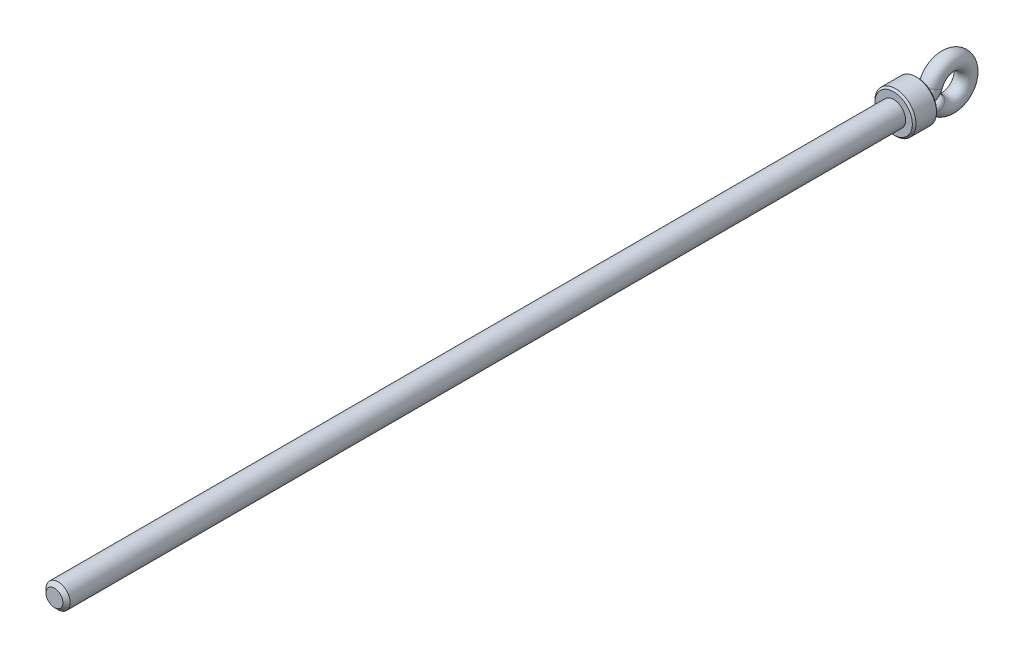
ISO-10303-21;
HEADER;
FILE_DESCRIPTION(('STEP AP214'),'2;1');
FILE_NAME('part.step','',(''),(''),'','','');
FILE_SCHEMA(('AUTOMOTIVE_DESIGN { 1 0 10303 214 1 1 1 1 }'));
ENDSEC;
DATA;
#1=APPLICATION_CONTEXT('core data for automotive mechanical design processes');
#2=APPLICATION_PROTOCOL_DEFINITION('international standard','automotive_design',2000,#1);
#3=PRODUCT_CONTEXT('',#1,'mechanical');
#4=PRODUCT('Part','Part','',(#3));
#5=PRODUCT_RELATED_PRODUCT_CATEGORY('part','',(#4));
#6=PRODUCT_DEFINITION_FORMATION('','',#4);
#7=PRODUCT_DEFINITION_CONTEXT('part definition',#1,'design');
#8=PRODUCT_DEFINITION('design','',#6,#7);
#9=PRODUCT_DEFINITION_SHAPE('','',#8);
#10=(LENGTH_UNIT() NAMED_UNIT(*) SI_UNIT(.MILLI.,.METRE.));
#11=(NAMED_UNIT(*) PLANE_ANGLE_UNIT() SI_UNIT($,.RADIAN.));
#12=(NAMED_UNIT(*) SI_UNIT($,.STERADIAN.) SOLID_ANGLE_UNIT());
#13=UNCERTAINTY_MEASURE_WITH_UNIT(LENGTH_MEASURE(1.E-05),#10,'distance_accuracy_value','');
#14=(GEOMETRIC_REPRESENTATION_CONTEXT(3) GLOBAL_UNCERTAINTY_ASSIGNED_CONTEXT((#13)) GLOBAL_UNIT_ASSIGNED_CONTEXT((#10,
#11,#12)) REPRESENTATION_CONTEXT('',''));
#15=CARTESIAN_POINT('',(0.,0.,0.));
#16=DIRECTION('',(0.,0.,1.));
#17=DIRECTION('',(1.,0.,0.));
#18=AXIS2_PLACEMENT_3D('',#15,#16,#17);
#19=CARTESIAN_POINT('',(0.,0.,695.));
#20=DIRECTION('',(0.,0.,-1.));
#21=DIRECTION('',(-1.,0.,0.));
#22=AXIS2_PLACEMENT_3D('',#19,#20,#21);
#23=CYLINDRICAL_SURFACE('',#22,10.);
#24=CARTESIAN_POINT('',(0.,0.,692.));
#25=DIRECTION('',(0.,0.,1.));
#26=DIRECTION('',(1.,0.,0.));
#27=AXIS2_PLACEMENT_3D('',#24,#25,#26);
#28=CIRCLE('',#27,10.);
#29=CARTESIAN_POINT('',(10.,0.,692.));
#30=VERTEX_POINT('',#29);
#31=EDGE_CURVE('E34',#30,#30,#28,.F.);
#32=ORIENTED_EDGE('',*,*,#31,.T.);
#33=EDGE_LOOP('',(#32));
#34=FACE_BOUND('',#33,.T.);
#35=CARTESIAN_POINT('',(0.,0.,0.));
#36=DIRECTION('',(0.,0.,1.));
#37=DIRECTION('',(1.,0.,0.));
#38=AXIS2_PLACEMENT_3D('',#35,#36,#37);
#39=CIRCLE('',#38,10.);
#40=CARTESIAN_POINT('',(10.,0.,0.));
#41=VERTEX_POINT('',#40);
#42=EDGE_CURVE('E144',#41,#41,#39,.T.);
#43=ORIENTED_EDGE('',*,*,#42,.T.);
#44=EDGE_LOOP('',(#43));
#45=FACE_BOUND('',#44,.T.);
#46=ADVANCED_FACE('F14',(#34,#45),#23,.T.);
#47=CARTESIAN_POINT('',(0.,0.,695.));
#48=DIRECTION('',(0.,0.,1.));
#49=DIRECTION('',(1.,0.,0.));
#50=AXIS2_PLACEMENT_3D('',#47,#48,#49);
#51=PLANE('',#50);
#52=CARTESIAN_POINT('',(0.,0.,695.));
#53=DIRECTION('',(0.,0.,1.));
#54=DIRECTION('',(1.,0.,0.));
#55=AXIS2_PLACEMENT_3D('',#52,#53,#54);
#56=CIRCLE('',#55,7.00000000000001);
#57=CARTESIAN_POINT('',(7.00000000000001,0.,695.));
#58=VERTEX_POINT('',#57);
#59=EDGE_CURVE('E114',#58,#58,#56,.T.);
#60=ORIENTED_EDGE('',*,*,#59,.T.);
#61=EDGE_LOOP('',(#60));
#62=FACE_BOUND('',#61,.T.);
#63=ADVANCED_FACE('F83',(#62),#51,.T.);
#64=CARTESIAN_POINT('',(0.,0.,-20.));
#65=DIRECTION('',(0.,0.,1.));
#66=DIRECTION('',(1.,0.,0.));
#67=AXIS2_PLACEMENT_3D('',#64,#65,#66);
#68=CYLINDRICAL_SURFACE('',#67,17.);
#69=CARTESIAN_POINT('',(0.,0.,-1.49999999999995));
#70=DIRECTION('',(0.,0.,1.));
#71=DIRECTION('',(1.,0.,0.));
#72=AXIS2_PLACEMENT_3D('',#69,#70,#71);
#73=CIRCLE('',#72,17.);
#74=CARTESIAN_POINT('',(17.,0.,-1.49999999999995));
#75=VERTEX_POINT('',#74);
#76=EDGE_CURVE('E132',#75,#75,#73,.F.);
#77=ORIENTED_EDGE('',*,*,#76,.T.);
#78=EDGE_LOOP('',(#77));
#79=FACE_BOUND('',#78,.T.);
#80=CARTESIAN_POINT('',(0.,0.,-18.5000000000001));
#81=DIRECTION('',(0.,0.,1.));
#82=DIRECTION('',(1.,0.,0.));
#83=AXIS2_PLACEMENT_3D('',#80,#81,#82);
#84=CIRCLE('',#83,17.);
#85=CARTESIAN_POINT('',(17.,0.,-18.5000000000001));
#86=VERTEX_POINT('',#85);
#87=EDGE_CURVE('E136',#86,#86,#84,.T.);
#88=ORIENTED_EDGE('',*,*,#87,.T.);
#89=EDGE_LOOP('',(#88));
#90=FACE_BOUND('',#89,.T.);
#91=ADVANCED_FACE('F89',(#79,#90),#68,.T.);
#92=CARTESIAN_POINT('',(0.,0.,-20.));
#93=DIRECTION('',(0.,0.,1.));
#94=DIRECTION('',(1.,0.,0.));
#95=AXIS2_PLACEMENT_3D('',#92,#93,#94);
#96=PLANE('',#95);
#97=CARTESIAN_POINT('',(0.,0.,-20.));
#98=DIRECTION('',(0.,0.,1.));
#99=DIRECTION('',(1.,0.,0.));
#100=AXIS2_PLACEMENT_3D('',#97,#98,#99);
#101=CIRCLE('',#100,9.);
#102=CARTESIAN_POINT('',(9.,0.,-20.));
#103=VERTEX_POINT('',#102);
#104=EDGE_CURVE('E122',#103,#103,#101,.T.);
#105=ORIENTED_EDGE('',*,*,#104,.T.);
#106=EDGE_LOOP('',(#105));
#107=FACE_BOUND('',#106,.T.);
#108=CARTESIAN_POINT('',(0.,0.,-20.));
#109=DIRECTION('',(0.,0.,1.));
#110=DIRECTION('',(1.,0.,0.));
#111=AXIS2_PLACEMENT_3D('',#108,#109,#110);
#112=CIRCLE('',#111,15.5);
#113=CARTESIAN_POINT('',(15.5,0.,-20.));
#114=VERTEX_POINT('',#113);
#115=EDGE_CURVE('E128',#114,#114,#112,.F.);
#116=ORIENTED_EDGE('',*,*,#115,.T.);
#117=EDGE_LOOP('',(#116));
#118=FACE_BOUND('',#117,.T.);
#119=ADVANCED_FACE('F255',(#107,#118),#96,.F.);
#120=CARTESIAN_POINT('',(0.,0.,0.));
#121=DIRECTION('',(0.,0.,1.));
#122=DIRECTION('',(1.,0.,0.));
#123=AXIS2_PLACEMENT_3D('',#120,#121,#122);
#124=PLANE('',#123);
#125=CARTESIAN_POINT('',(0.,0.,0.));
#126=DIRECTION('',(0.,0.,1.));
#127=DIRECTION('',(1.,0.,0.));
#128=AXIS2_PLACEMENT_3D('',#125,#126,#127);
#129=CIRCLE('',#128,15.5000000000002);
#130=CARTESIAN_POINT('',(15.5000000000002,0.,0.));
#131=VERTEX_POINT('',#130);
#132=EDGE_CURVE('E140',#131,#131,#129,.T.);
#133=ORIENTED_EDGE('',*,*,#132,.T.);
#134=EDGE_LOOP('',(#133));
#135=FACE_BOUND('',#134,.T.);
#136=ORIENTED_EDGE('',*,*,#42,.F.);
#137=EDGE_LOOP('',(#136));
#138=FACE_BOUND('',#137,.T.);
#139=ADVANCED_FACE('F68',(#135,#138),#124,.T.);
#140=CARTESIAN_POINT('',(0.,-5.6190989012386,-31.0922421814982));
#141=DIRECTION('',(0.,-0.92718385456679,-0.374606593415906));
#142=DIRECTION('',(0.,0.374606593415906,-0.92718385456679));
#143=AXIS2_PLACEMENT_3D('',#140,#141,#142);
#144=PLANE('',#143);
#145=CARTESIAN_POINT('',(-0.267814899753251,-4.24294874486969,-34.4983333418537));
#146=CARTESIAN_POINT('',(-0.535964039163629,-3.18618303783898,-37.1139202504667));
#147=CARTESIAN_POINT('',(-0.624901432757596,-5.31433814850181,-38.9828767941055));
#148=CARTESIAN_POINT('',(-0.10669981189394,-4.23721080551919,-34.5125352401058));
#149=CARTESIAN_POINT('',(-0.213372702047782,-3.17709115436088,-37.1364234517361));
#150=CARTESIAN_POINT('',(-0.24896622772436,-5.29458411469505,-39.010392555168));
#151=CARTESIAN_POINT('',(0.0557192743773867,-4.23666309919185,-34.5138908608362));
#152=CARTESIAN_POINT('',(0.111416626490471,-3.17622472220716,-37.1385679465691));
#153=CARTESIAN_POINT('',(0.130011640243449,-5.29269527178391,-39.0130149226404));
#154=CARTESIAN_POINT('',(0.378406067436832,-4.2459646647267,-34.4908686782647));
#155=CARTESIAN_POINT('',(0.75758345158823,-3.1909667929823,-37.1020800410015));
#156=CARTESIAN_POINT('',(0.882947490699488,-5.32472333482806,-38.9684170545828));
#157=CARTESIAN_POINT('',(0.538674013800429,-4.25581276889777,-34.4664937650998));
#158=CARTESIAN_POINT('',(1.07983936736787,-3.20661368418201,-37.0633526262963));
#159=CARTESIAN_POINT('',(1.25690603219717,-5.35863621941736,-38.9212024169067));
#160=CARTESIAN_POINT('',(0.850088972014333,-4.28527806984585,-34.3935645860912));
#161=CARTESIAN_POINT('',(1.71070497526709,-3.25374810830347,-36.9466908328098));
#162=CARTESIAN_POINT('',(1.98354093470394,-5.45975590992779,-38.7795031073018));
#163=CARTESIAN_POINT('',(1.00133655074529,-4.30474694972162,-34.34537741746));
#164=CARTESIAN_POINT('',(2.02022082468757,-3.28511609734602,-36.8690523355125));
#165=CARTESIAN_POINT('',(2.33645195176725,-5.52645716066193,-38.6857360033921));
#166=CARTESIAN_POINT('',(1.29332499429876,-4.35265493436786,-34.2268009944884));
#167=CARTESIAN_POINT('',(2.62575498343679,-3.36316682901066,-36.6758699956699));
#168=CARTESIAN_POINT('',(3.0177583200599,-5.68980738952441,-38.4540301378224));
#169=CARTESIAN_POINT('',(1.43406464981001,-4.3810950696393,-34.1564091895687));
#170=CARTESIAN_POINT('',(2.92236085455471,-3.41003385837555,-36.5598700274302));
#171=CARTESIAN_POINT('',(3.34615084956294,-5.78645980803033,-38.3160863016868));
#172=CARTESIAN_POINT('',(1.70559193340705,-4.44694228423316,-33.9934316143933));
#173=CARTESIAN_POINT('',(3.50581556944884,-3.52019578102394,-36.2872097009361));
#174=CARTESIAN_POINT('',(3.97971451127664,-6.00891158281849,-37.9950991149901));
#175=CARTESIAN_POINT('',(1.8359668712502,-4.48458778863466,-33.900255721359));
#176=CARTESIAN_POINT('',(3.79246172010584,-3.58416094446185,-36.1288903658342));
#177=CARTESIAN_POINT('',(4.28392269958881,-6.13548232047446,-37.8108522184167));
#178=CARTESIAN_POINT('',(2.07903816647017,-4.56717462556752,-33.6958461270012));
#179=CARTESIAN_POINT('',(4.34129872883696,-3.72715987201687,-35.7749556001902));
#180=CARTESIAN_POINT('',(4.85108905510651,-6.41121009640481,-37.4043532677781));
#181=CARTESIAN_POINT('',(2.19173041569785,-4.61211764858216,-33.5846082415849));
#182=CARTESIAN_POINT('',(4.60364524530678,-3.80646547441348,-35.5786673462961));
#183=CARTESIAN_POINT('',(5.1140376366307,-6.56037236750889,-37.182092407072));
#184=CARTESIAN_POINT('',(2.40231481600309,-4.71048518827116,-33.3411400372977));
#185=CARTESIAN_POINT('',(5.11142479367259,-3.98388725587503,-35.1395330274909));
#186=CARTESIAN_POINT('',(5.60540123733802,-6.88438053582401,-36.6927903523807));
#187=CARTESIAN_POINT('',(2.49915407592637,-4.76422609928737,-33.2081266149509));
#188=CARTESIAN_POINT('',(5.35503971113456,-4.08300472606897,-34.89420868007));
#189=CARTESIAN_POINT('',(5.83135951049494,-7.06015030018002,-36.4240392911957));
#190=CARTESIAN_POINT('',(2.6685229621291,-4.87683900319797,-32.9293998969567));
#191=CARTESIAN_POINT('',(5.8029016387366,-4.29594611758227,-34.3671602413872));
#192=CARTESIAN_POINT('',(6.22655357830282,-7.42544617922704,-35.857502136448));
#193=CARTESIAN_POINT('',(2.74104712599448,-4.935712145316,-32.7836837568811));
#194=CARTESIAN_POINT('',(6.00674674067439,-4.41005227440125,-34.0847375927508));
#195=CARTESIAN_POINT('',(6.39577662732095,-7.61497537337142,-35.5597095380411));
#196=CARTESIAN_POINT('',(2.86267410632611,-5.05958707808983,-32.4770825393047));
#197=CARTESIAN_POINT('',(6.37581947811972,-4.65663337946306,-33.4744279413114));
#198=CARTESIAN_POINT('',(6.67957291476036,-8.01050509923215,-34.9296020277957));
#199=CARTESIAN_POINT('',(2.91066484290466,-5.12474243781629,-32.3158173650161));
#200=CARTESIAN_POINT('',(6.53823980201785,-4.7898488931911,-33.1447079746119));
#201=CARTESIAN_POINT('',(6.79155130011042,-8.2168631059956,-34.5963623398276));
#202=CARTESIAN_POINT('',(2.97723912694888,-5.2571327776788,-31.9881397753031));
#203=CARTESIAN_POINT('',(6.80459024537531,-5.06828018911193,-32.4555663344986));
#204=CARTESIAN_POINT('',(6.94689129621408,-8.6327300545619,-33.9156505539856));
#205=CARTESIAN_POINT('',(2.99581930203228,-5.32436799540214,-31.8217267718295));
#206=CARTESIAN_POINT('',(6.90756393001704,-5.21365603767943,-32.0957484829051));
#207=CARTESIAN_POINT('',(6.99024503807571,-8.84223935492987,-33.5681768286418));
#208=CARTESIAN_POINT('',(3.00297095485652,-5.46003619821918,-31.4859361866104));
#209=CARTESIAN_POINT('',(7.04792453219719,-5.51541300187756,-31.3488737878915));
#210=CARTESIAN_POINT('',(7.00693222799816,-9.2617574972421,-32.863758346261));
#211=CARTESIAN_POINT('',(2.99110810652139,-5.52847252902018,-31.3165503239488));
#212=CARTESIAN_POINT('',(7.08320525408174,-5.67193252423053,-30.9614743758125));
#213=CARTESIAN_POINT('',(6.97925224854835,-9.47173038745556,-32.5067492305341));
#214=CARTESIAN_POINT('',(2.93647501381529,-5.66359719160117,-30.9821050480223));
#215=CARTESIAN_POINT('',(7.07764622811232,-5.98967234228318,-30.1750407293435));
#216=CARTESIAN_POINT('',(6.85177503223625,-9.88339870069763,-31.7989770209835));
#217=CARTESIAN_POINT('',(2.89370596052631,-5.73028559064137,-30.8170454682825));
#218=CARTESIAN_POINT('',(7.03563962131795,-6.15079719396175,-29.7762427271952));
#219=CARTESIAN_POINT('',(6.75198057456524,-10.0850944423994,-31.44821368699));
#220=CARTESIAN_POINT('',(2.77884994105621,-5.85907311491569,-30.4982851600671));
#221=CARTESIAN_POINT('',(6.87093161465208,-6.47018696868093,-28.9857252946722));
#222=CARTESIAN_POINT('',(6.483983195794,-10.4721971890889,-30.7685131820488));
#223=CARTESIAN_POINT('',(2.70714713847289,-5.92122023517829,-30.3444656397274));
#224=CARTESIAN_POINT('',(6.74822619668567,-6.62826029452503,-28.5944800839996));
#225=CARTESIAN_POINT('',(6.31667665642216,-10.6577803335356,-30.4393533096008));
#226=CARTESIAN_POINT('',(2.53613119994427,-6.03993497912505,-30.0506363376781));
#227=CARTESIAN_POINT('',(6.42064236153453,-6.93744162777071,-27.8292294307615));
#228=CARTESIAN_POINT('',(5.9176394665236,-11.0104370540509,-29.8088517089643));
#229=CARTESIAN_POINT('',(2.43682318052268,-6.09650363412717,-29.9106240033669));
#230=CARTESIAN_POINT('',(6.21498311331832,-7.08820123680677,-27.4560863044102));
#231=CARTESIAN_POINT('',(5.68592075455222,-11.177514052147,-29.5075048395134));
#232=CARTESIAN_POINT('',(2.21636936017603,-6.2007470634353,-29.6526124619314));
#233=CARTESIAN_POINT('',(5.73013766037578,-7.37181670926837,-26.7541133770951));
#234=CARTESIAN_POINT('',(5.17152850707809,-11.4840832244933,-28.9509792022461));
#235=CARTESIAN_POINT('',(2.09591453127465,-6.24862686251161,-29.5341058006934));
#236=CARTESIAN_POINT('',(5.45269078156246,-7.50469196855701,-26.4252355696854));
#237=CARTESIAN_POINT('',(4.89046723963124,-11.624217886761,-28.6947422138669));
#238=CARTESIAN_POINT('',(1.83464081316523,-6.33585912965116,-29.3181983631026));
#239=CARTESIAN_POINT('',(4.82763579395748,-7.75093360432913,-25.8157661342221));
#240=CARTESIAN_POINT('',(4.28082856405543,-11.8786970961703,-28.22715060489));
#241=CARTESIAN_POINT('',(1.69382006872958,-6.37521082003178,-29.2207995115818));
#242=CARTESIAN_POINT('',(4.48000858770836,-7.86386505816323,-25.5362509775002));
#243=CARTESIAN_POINT('',(3.95224682706205,-11.9930392913223,-28.0158000775468));
#244=CARTESIAN_POINT('',(1.40028972794923,-6.44305189842871,-29.05288695032));
#245=CARTESIAN_POINT('',(3.73660921746577,-8.0611549293417,-25.0479414110342));
#246=CARTESIAN_POINT('',(3.2673426985226,-12.1896978973501,-27.6510240868038));
#247=CARTESIAN_POINT('',(1.24804435611005,-6.47182363348289,-28.9816744071374));
#248=CARTESIAN_POINT('',(3.34282932990734,-8.1458893792419,-24.8382162880546));
#249=CARTESIAN_POINT('',(2.91210349749226,-12.2728481817796,-27.496094226833));
#250=CARTESIAN_POINT('',(0.932747091781649,-6.51910388164867,-28.864651686476));
#251=CARTESIAN_POINT('',(2.51384420994787,-8.28641586853571,-24.4904010218468));
#252=CARTESIAN_POINT('',(2.17640988072989,-12.4092924860004,-27.2413266673811));
#253=CARTESIAN_POINT('',(0.769710861092856,-6.53762691917468,-28.81880555981));
#254=CARTESIAN_POINT('',(2.07939645923682,-8.34195358605524,-24.3529403473455));
#255=CARTESIAN_POINT('',(1.79599200919864,-12.4626287592013,-27.1414110029766));
#256=CARTESIAN_POINT('',(0.504559541538937,-6.55856746018863,-28.766975902043));
#257=CARTESIAN_POINT('',(1.36676595853375,-8.40503161707914,-24.1968167420188));
#258=CARTESIAN_POINT('',(1.17730559693496,-12.5228887941041,-27.0284221432915));
#259=CARTESIAN_POINT('',(0.404312496262393,-6.5644661816725,-28.7523760540463));
#260=CARTESIAN_POINT('',(1.09603956052915,-8.42286039325096,-24.1526889725034));
#261=CARTESIAN_POINT('',(0.9433958246131,-12.5398515840755,-26.9965840252859));
#262=CARTESIAN_POINT('',(0.202725883288975,-6.57234286012485,-28.7328805907603));
#263=CARTESIAN_POINT('',(0.550143007606992,-8.44670511194332,-24.0936712227445));
#264=CARTESIAN_POINT('',(0.473027060999225,-12.5624983513959,-26.9540664581324));
#265=CARTESIAN_POINT('',(0.101386327901199,-6.57432086122103,-28.7279848662511));
#266=CARTESIAN_POINT('',(0.275190979382255,-8.45270188381369,-24.0788286915253));
#267=CARTESIAN_POINT('',(0.236568098428444,-12.5681824556865,-26.9433867708464));
#268=CARTESIAN_POINT('',(-0.165237092147791,-6.57431605344368,-28.7279967659176));
#269=CARTESIAN_POINT('',(-0.448499740087207,-8.45268614664155,-24.0788676423932));
#270=CARTESIAN_POINT('',(-0.385553214998983,-12.5681698511401,-26.9434137921355));
#271=CARTESIAN_POINT('',(-0.330598420166323,-6.56905430543396,-28.7410200492424));
#272=CARTESIAN_POINT('',(-0.896849121504695,-8.43673745589875,-24.1183420371798));
#273=CARTESIAN_POINT('',(-0.771396313677786,-12.5530513462082,-26.9718249240442));
#274=CARTESIAN_POINT('',(-0.656720245210439,-6.5481568360175,-28.7927431010648));
#275=CARTESIAN_POINT('',(-1.77657720646737,-8.37363171091723,-24.2745342369586));
#276=CARTESIAN_POINT('',(-1.5323472387816,-12.4929374464877,-27.0846009430529));
#277=CARTESIAN_POINT('',(-0.817474803317348,-6.53250830110106,-28.8314745841117));
#278=CARTESIAN_POINT('',(-2.20702699852984,-8.32657126632454,-24.391012924686));
#279=CARTESIAN_POINT('',(-1.90744120772978,-12.447905148927,-27.1690349419063));
#280=CARTESIAN_POINT('',(-1.1295537145794,-6.4913478415649,-28.9333502963902));
#281=CARTESIAN_POINT('',(-3.03315971448818,-8.20372522900593,-24.6950675366476));
#282=CARTESIAN_POINT('',(-2.63562533402929,-12.329222364088,-27.3909154754928));
#283=CARTESIAN_POINT('',(-1.2808868248304,-6.46584524001853,-28.9964714502056));
#284=CARTESIAN_POINT('',(-3.42815911377845,-8.12821704941378,-24.8819568392814));
#285=CARTESIAN_POINT('',(-2.98873592460433,-12.2555989269648,-27.5283119014236));
#286=CARTESIAN_POINT('',(-1.57007644312573,-6.40577953460372,-29.1451392880189));
#287=CARTESIAN_POINT('',(-4.16927867998275,-7.95235857172891,-25.3172218454611));
#288=CARTESIAN_POINT('',(-3.6635117006229,-12.0817197266258,-27.8514948458113));
#289=CARTESIAN_POINT('',(-1.70793593426103,-6.37121844257366,-29.2306809925423));
#290=CARTESIAN_POINT('',(-4.51497923938364,-7.85234276624688,-25.5647696507435));
#291=CARTESIAN_POINT('',(-3.985183846612,-11.9814698769164,-28.0372706194359));
#292=CARTESIAN_POINT('',(-1.967863123793,-6.29370238387418,-29.422539970358));
#293=CARTESIAN_POINT('',(-5.14972343050821,-7.63126996421923,-26.1119440366901));
#294=CARTESIAN_POINT('',(-4.59168062218068,-11.7558350754682,-28.453232261639));
#295=CARTESIAN_POINT('',(-2.08976377541197,-6.25066887428398,-29.529051644201));
#296=CARTESIAN_POINT('',(-5.43810290132604,-7.51038127971641,-26.4111540304297));
#297=CARTESIAN_POINT('',(-4.8761154759454,-11.6302146221968,-28.6838334054978));
#298=CARTESIAN_POINT('',(-2.31309727203604,-6.15770426512614,-29.7591471261606));
#299=CARTESIAN_POINT('',(-5.94668038335633,-7.25381463730369,-27.0461787540907));
#300=CARTESIAN_POINT('',(-5.39722696806792,-11.3576735593833,-29.1809325311169));
#301=CARTESIAN_POINT('',(-2.41452738539323,-6.1077722464971,-29.8827332090339));
#302=CARTESIAN_POINT('',(-6.16710259168332,-7.11849846276234,-27.3810980387527));
#303=CARTESIAN_POINT('',(-5.63389723258058,-11.2107501115972,-29.4474352957918));
#304=CARTESIAN_POINT('',(-2.5966803852752,-6.00116740182763,-30.1465894585858));
#305=CARTESIAN_POINT('',(-6.54073421000398,-6.83544924507487,-28.0816694363207));
#306=CARTESIAN_POINT('',(-6.0589208989792,-10.8954931546131,-30.0149538201397));
#307=CARTESIAN_POINT('',(-2.67684921633415,-5.94436178532914,-30.2871882931814));
#308=CARTESIAN_POINT('',(-6.69281576102581,-6.68778972125284,-28.4471395825142));
#309=CARTESIAN_POINT('',(-6.24598150477781,-10.7267311856226,-30.3166432456418));
#310=CARTESIAN_POINT('',(-2.81141791503929,-5.82662073790982,-30.5786076117564));
#311=CARTESIAN_POINT('',(-6.92206836095539,-6.38870384901207,-29.1874030929399));
#312=CARTESIAN_POINT('',(-6.55997513508736,-10.3748867902622,-30.9400082050123));
#313=CARTESIAN_POINT('',(-2.86581410690899,-5.76568471931359,-30.7294295502835));
#314=CARTESIAN_POINT('',(-7.00002752535391,-6.23752461902532,-29.5615848175898));
#315=CARTESIAN_POINT('',(-6.6868995827865,-10.1918023255077,-31.2616865823731));
#316=CARTESIAN_POINT('',(-2.94897598749161,-5.639498571864,-31.0417512249192));
#317=CARTESIAN_POINT('',(-7.08546210507058,-5.93216835664194,-30.3173680882232));
#318=CARTESIAN_POINT('',(-6.88094397081496,-9.81020111189018,-31.9254171033894));
#319=CARTESIAN_POINT('',(-2.97693941011896,-5.5741742356464,-31.2034346306996));
#320=CARTESIAN_POINT('',(-7.09181436223382,-5.77812321895293,-30.6986431833499));
#321=CARTESIAN_POINT('',(-6.94619195694449,-9.61138862839213,-32.2677902753251));
#322=CARTESIAN_POINT('',(-3.00400264473196,-5.44269169305799,-31.5288653433139));
#323=CARTESIAN_POINT('',(-7.0344080491124,-5.47620956196366,-31.445905706631));
#324=CARTESIAN_POINT('',(-7.00933950437414,-9.20830719904835,-32.9539945343634));
#325=CARTESIAN_POINT('',(-3.00309807278968,-5.37653336156058,-31.6926129598471));
#326=CARTESIAN_POINT('',(-6.97169088091768,-5.32837189857584,-31.811816763722));
#327=CARTESIAN_POINT('',(-7.0072288365091,-9.00403742915886,-33.297825834972));
#328=CARTESIAN_POINT('',(-2.97226379285404,-5.2434339065651,-32.0220456711033));
#329=CARTESIAN_POINT('',(-6.7810942466621,-5.0389682080142,-32.5281160335613));
#330=CARTESIAN_POINT('',(-6.93528218332624,-8.58990410920832,-33.9862929927512));
#331=CARTESIAN_POINT('',(-2.94157953478853,-5.17651720011601,-32.1876703315093));
#332=CARTESIAN_POINT('',(-6.65256825978373,-4.89751561236648,-32.8782234934305));
#333=CARTESIAN_POINT('',(-6.86368558117342,-8.38003329544211,-34.3307170389853));
#334=CARTESIAN_POINT('',(-2.85096997132787,-5.04551528630781,-32.5119114461484));
#335=CARTESIAN_POINT('',(-6.33809144934531,-4.62815335371664,-33.5449184786212));
#336=CARTESIAN_POINT('',(-6.65226326643107,-7.9658134137187,-35.0014299241157));
#337=CARTESIAN_POINT('',(-2.791041290668,-4.9814304067172,-32.6705270891259));
#338=CARTESIAN_POINT('',(-6.15301224015491,-4.50004187549883,-33.8620055141299));
#339=CARTESIAN_POINT('',(-6.51242967822388,-7.76146498600525,-35.3277166648395));
#340=CARTESIAN_POINT('',(-2.64271969312055,-4.85730369762863,-32.9777514749489));
#341=CARTESIAN_POINT('',(-5.73212439282308,-4.25846022465411,-34.4599410821623));
#342=CARTESIAN_POINT('',(-6.1663459506161,-7.36243913289173,-35.9561759020384));
#343=CARTESIAN_POINT('',(-2.55405610709969,-4.79730715510843,-33.126248128591));
#344=CARTESIAN_POINT('',(-5.49644403070212,-4.14483256782397,-34.741179401767));
#345=CARTESIAN_POINT('',(-5.95946424990454,-7.1678748456207,-36.2580835617053));
#346=CARTESIAN_POINT('',(-2.35060582109398,-4.6838755068201,-33.4070013100308));
#347=CARTESIAN_POINT('',(-4.98400245652423,-3.93533758283828,-35.2596976849618));
#348=CARTESIAN_POINT('',(-5.48474691588556,-6.79714752840173,-36.8256230192003));
#349=CARTESIAN_POINT('',(-2.2358201549264,-4.63044014151316,-33.5392584802095));
#350=CARTESIAN_POINT('',(-4.70754737699064,-3.83911799344867,-35.4978495257012));
#351=CARTESIAN_POINT('',(-5.21691369481845,-6.62098377062994,-37.0912562519731));
#352=CARTESIAN_POINT('',(-1.98546547851585,-4.53286402953773,-33.7807678321674));
#353=CARTESIAN_POINT('',(-4.12730577403505,-3.66728339495908,-35.9231550813848));
#354=CARTESIAN_POINT('',(-4.63275278321325,-6.29704641647726,-37.5736856392028));
#355=CARTESIAN_POINT('',(-1.85033996382722,-4.48856390973796,-33.8904144762886));
#356=CARTESIAN_POINT('',(-3.82414878836826,-3.59097237799392,-36.1120314762461));
#357=CARTESIAN_POINT('',(-4.31745991563456,-6.14879083423836,-37.7913248227227));
#358=CARTESIAN_POINT('',(-1.5613123139203,-4.40959814038689,-34.0858616138793));
#359=CARTESIAN_POINT('',(-3.19357721503409,-3.45742146293026,-36.4425815903819));
#360=CARTESIAN_POINT('',(-3.643062065839,-5.88302968473247,-38.1774757460196));
#361=CARTESIAN_POINT('',(-1.40741605342387,-4.37492948753143,-34.1716695407875));
#362=CARTESIAN_POINT('',(-2.86574251873184,-3.39984359530072,-36.5850918135995));
#363=CARTESIAN_POINT('',(-3.28397079130649,-5.76551453258944,-38.3460028008478));
#364=CARTESIAN_POINT('',(-1.09303354582871,-4.31802970787059,-34.3125014373883));
#365=CARTESIAN_POINT('',(-2.20906449564348,-3.30662991005437,-36.8158037805113));
#366=CARTESIAN_POINT('',(-2.55041160694879,-5.57187099924453,-38.6216468005123));
#367=CARTESIAN_POINT('',(-0.933210394927678,-4.29528479570716,-34.3687970704662));
#368=CARTESIAN_POINT('',(-1.88044231306173,-3.26985154109046,-36.9068334380239));
#369=CARTESIAN_POINT('',(-2.17749092157962,-5.49403784440166,-38.7313065637311));
#370=CARTESIAN_POINT('',(-0.605342130105587,-4.26076431514311,-34.4542382580838));
#371=CARTESIAN_POINT('',(-1.21427168553867,-3.21450025580672,-37.0438326765494));
#372=CARTESIAN_POINT('',(-1.41246497033531,-5.37566830736178,-38.8974393176044));
#373=CARTESIAN_POINT('',(-0.437300017329104,-4.24898477376296,-34.4833936460931));
#374=CARTESIAN_POINT('',(-0.875838035914701,-3.19576201414789,-37.0902114521353));
#375=CARTESIAN_POINT('',(-1.0203667071309,-5.33511841673627,-38.9539315720234));
#376=CARTESIAN_POINT('',(-0.267814899753251,-4.24294874486969,-34.4983333418537));
#377=CARTESIAN_POINT('',(-0.535964039163629,-3.18618303783898,-37.1139202504667));
#378=CARTESIAN_POINT('',(-0.624901432757596,-5.31433814850181,-38.9828767941055));
#379=(BOUNDED_SURFACE() B_SPLINE_SURFACE(3,2,((#145,#146,#147),(#148,#149,#150),(#151,#152,
#153),(#154,#155,#156),(#157,#158,#159),(#160,#161,#162),(#163,#164,#165),(#166,#167,#168),
(#169,#170,#171),(#172,#173,#174),(#175,#176,#177),(#178,#179,#180),(#181,#182,#183),(#184,#185,
#186),(#187,#188,#189),(#190,#191,#192),(#193,#194,#195),(#196,#197,#198),(#199,#200,#201),
(#202,#203,#204),(#205,#206,#207),(#208,#209,#210),(#211,#212,#213),(#214,#215,#216),(#217,#218,
#219),(#220,#221,#222),(#223,#224,#225),(#226,#227,#228),(#229,#230,#231),(#232,#233,#234),
(#235,#236,#237),(#238,#239,#240),(#241,#242,#243),(#244,#245,#246),(#247,#248,#249),(#250,#251,
#252),(#253,#254,#255),(#256,#257,#258),(#259,#260,#261),(#262,#263,#264),(#265,#266,#267),
(#268,#269,#270),(#271,#272,#273),(#274,#275,#276),(#277,#278,#279),(#280,#281,#282),(#283,#284,
#285),(#286,#287,#288),(#289,#290,#291),(#292,#293,#294),(#295,#296,#297),(#298,#299,#300),
(#301,#302,#303),(#304,#305,#306),(#307,#308,#309),(#310,#311,#312),(#313,#314,#315),(#316,#317,
#318),(#319,#320,#321),(#322,#323,#324),(#325,#326,#327),(#328,#329,#330),(#331,#332,#333),
(#334,#335,#336),(#337,#338,#339),(#340,#341,#342),(#343,#344,#345),(#346,#347,#348),(#349,#350,
#351),(#352,#353,#354),(#355,#356,#357),(#358,#359,#360),(#361,#362,#363),(#364,#365,#366),
(#367,#368,#369),(#370,#371,#372),(#373,#374,#375),(#376,#377,#378)),.UNSPECIFIED.,.T.,.F.,
.F.) B_SPLINE_SURFACE_WITH_KNOTS((4,2,2,2,2,2,2,2,2,2,2,2,2,2,2,2,2,2,2,2,2,2,2,2,2,2,2,2,2,2,2,
2,2,2,2,2,2,2,4),(3,3),(0.,0.484906264846502,0.969758069245291,1.44735806827545,
1.92501294776246,2.41667025983676,2.90844162812504,3.42538627880343,3.94244698399304,
4.48123213406685,5.02007905983654,5.56665623703478,6.11321235103519,6.65273863742296,
7.192164991231,7.71645479841437,8.24079239575513,8.74989761023979,9.25827946256416,
9.56221187526015,9.86614086717984,10.3614773083335,10.8574259526719,11.3529065173159,
11.8482771316999,12.3484768464242,12.8487432651774,13.3609898282839,13.8733094276628,
14.400721633121,14.928213932404,15.4694302791303,16.0107091054845,16.5572423955035,
17.1037540594757,17.63972627449,18.17553117346,18.6858135803125,19.1959110293021),(0.,1.),
.UNSPECIFIED.) GEOMETRIC_REPRESENTATION_ITEM() RATIONAL_B_SPLINE_SURFACE(((1.,0.815987553315359,
1.),(1.,0.816600922174567,1.),(1.,0.816659702119576,1.),(1.,0.815664998686587,1.),(1.,
0.814611640227577,1.),(1.,0.811484782161348,1.),(1.,0.80942677618711,1.),(1.,0.804418708735595,
1.),(1.,0.801468544780437,1.),(1.,0.794733377815299,1.),(1.,0.790926436806535,1.),(1.,
0.782715109891841,1.),(1.,0.778310585593635,1.),(1.,0.768849524284246,1.),(1.,0.763771152630644,
1.),(1.,0.753351141957017,1.),(1.,0.748009444089199,1.),(1.,0.737010717043996,1.),(1.,
0.731349868744408,1.),(1.,0.720103791794341,1.),(1.,0.714518571888633,1.),(1.,0.703492263754392,
1.),(1.,0.698054392693946,1.),(1.,0.687539448012322,1.),(1.,0.68246236049533,1.),(1.,
0.672842809885072,1.),(1.,0.668294310343447,1.),(1.,0.659749104511278,1.),(1.,0.655752296172079,
1.),(1.,0.648490086234698,1.),(1.,0.645207308076196,1.),(1.,0.639291985461389,1.),(1.,
0.636659500302576,1.),(1.,0.632157919227299,1.),(1.,0.630268867976811,1.),(1.,0.627180167799288,
1.),(1.,0.625979543148585,1.),(1.,0.624625198180391,1.),(1.,0.624244635266044,1.),(1.,
0.623736779399677,1.),(1.,0.623609483597137,1.),(1.,0.623609696254532,1.),(1.,0.623948162467291,
1.),(1.,0.625297953263754,1.),(1.,0.626310108939026,1.),(1.,0.628991015498396,1.),(1.,
0.630659145781884,1.),(1.,0.634625776555858,1.),(1.,0.636924137081079,1.),(1.,0.642141211291449,
1.),(1.,0.645065754045356,1.),(1.,0.651475007803571,1.),(1.,0.654959793456991,1.),(1.,
0.662522518643565,1.),(1.,0.666612664276948,1.),(1.,0.675248765877389,1.),(1.,0.679794786750875,
1.),(1.,0.689397782923427,1.),(1.,0.694465865330274,1.),(1.,0.70488797343684,1.),(1.,
0.710242042443573,1.),(1.,0.721251967379912,1.),(1.,0.72691205082702,1.),(1.,0.738242280753834,
1.),(1.,0.743912428319816,1.),(1.,0.755132062381895,1.),(1.,0.760679843231378,1.),(1.,
0.771378557833266,1.),(1.,0.776529507280024,1.),(1.,0.786098478080735,1.),(1.,0.790528718229196,
1.),(1.,0.798533119306611,1.),(1.,0.802107547048631,1.),(1.,0.808029374078312,1.),(1.,
0.810427111206528,1.),(1.,0.814083377645127,1.),(1.,0.815342319559778,1.),(1.,0.815987553315359,1.))) REPRESENTATION_ITEM('') SURFACE());
#380=CARTESIAN_POINT('',(-0.267814899753251,-4.24294874486969,-34.4983333418537));
#381=CARTESIAN_POINT('',(-0.437300017329104,-4.24898477376296,-34.4833936460931));
#382=CARTESIAN_POINT('',(-0.605342130105587,-4.26076431514311,-34.4542382580838));
#383=CARTESIAN_POINT('',(-0.933210394927678,-4.29528479570716,-34.3687970704662));
#384=CARTESIAN_POINT('',(-1.09303354582871,-4.31802970787059,-34.3125014373883));
#385=CARTESIAN_POINT('',(-1.40741605342387,-4.37492948753143,-34.1716695407875));
#386=CARTESIAN_POINT('',(-1.5613123139203,-4.40959814038689,-34.0858616138793));
#387=CARTESIAN_POINT('',(-1.85033996382722,-4.48856390973796,-33.8904144762886));
#388=CARTESIAN_POINT('',(-1.98546547851585,-4.53286402953773,-33.7807678321674));
#389=CARTESIAN_POINT('',(-2.2358201549264,-4.63044014151316,-33.5392584802095));
#390=CARTESIAN_POINT('',(-2.35060582109398,-4.6838755068201,-33.4070013100308));
#391=CARTESIAN_POINT('',(-2.55405610709969,-4.79730715510843,-33.126248128591));
#392=CARTESIAN_POINT('',(-2.64271969312055,-4.85730369762863,-32.9777514749489));
#393=CARTESIAN_POINT('',(-2.791041290668,-4.9814304067172,-32.6705270891259));
#394=CARTESIAN_POINT('',(-2.85096997132787,-5.04551528630781,-32.5119114461484));
#395=CARTESIAN_POINT('',(-2.94157953478853,-5.17651720011601,-32.1876703315093));
#396=CARTESIAN_POINT('',(-2.97226379285404,-5.2434339065651,-32.0220456711033));
#397=CARTESIAN_POINT('',(-3.00309807278968,-5.37653336156058,-31.6926129598471));
#398=CARTESIAN_POINT('',(-3.00400264473196,-5.44269169305799,-31.5288653433139));
#399=CARTESIAN_POINT('',(-2.97693941011896,-5.5741742356464,-31.2034346306996));
#400=CARTESIAN_POINT('',(-2.94897598749161,-5.639498571864,-31.0417512249192));
#401=CARTESIAN_POINT('',(-2.86581410690899,-5.76568471931359,-30.7294295502835));
#402=CARTESIAN_POINT('',(-2.81141791503929,-5.82662073790982,-30.5786076117564));
#403=CARTESIAN_POINT('',(-2.67684921633415,-5.94436178532914,-30.2871882931814));
#404=CARTESIAN_POINT('',(-2.5966803852752,-6.00116740182763,-30.1465894585858));
#405=CARTESIAN_POINT('',(-2.41452738539323,-6.1077722464971,-29.8827332090339));
#406=CARTESIAN_POINT('',(-2.31309727203604,-6.15770426512614,-29.7591471261606));
#407=CARTESIAN_POINT('',(-2.08976377541197,-6.25066887428398,-29.529051644201));
#408=CARTESIAN_POINT('',(-1.967863123793,-6.29370238387418,-29.422539970358));
#409=CARTESIAN_POINT('',(-1.70793593426103,-6.37121844257366,-29.2306809925423));
#410=CARTESIAN_POINT('',(-1.57007644312574,-6.40577953460372,-29.1451392880189));
#411=CARTESIAN_POINT('',(-1.2808868248304,-6.46584524001853,-28.9964714502056));
#412=CARTESIAN_POINT('',(-1.1295537145794,-6.49134784156489,-28.9333502963902));
#413=CARTESIAN_POINT('',(-0.817474803317348,-6.53250830110106,-28.8314745841117));
#414=CARTESIAN_POINT('',(-0.656720245210439,-6.5481568360175,-28.7927431010648));
#415=CARTESIAN_POINT('',(-0.330598420166324,-6.56905430543396,-28.7410200492424));
#416=CARTESIAN_POINT('',(-0.165237092147791,-6.57431605344368,-28.7279967659176));
#417=CARTESIAN_POINT('',(0.101386327901199,-6.57432086122103,-28.7279848662511));
#418=CARTESIAN_POINT('',(0.202725883288974,-6.57234286012485,-28.7328805907603));
#419=CARTESIAN_POINT('',(0.404312496262393,-6.5644661816725,-28.7523760540463));
#420=CARTESIAN_POINT('',(0.504559541538937,-6.55856746018863,-28.766975902043));
#421=CARTESIAN_POINT('',(0.769710861092857,-6.53762691917468,-28.81880555981));
#422=CARTESIAN_POINT('',(0.932747091781649,-6.51910388164867,-28.864651686476));
#423=CARTESIAN_POINT('',(1.24804435611005,-6.47182363348289,-28.9816744071374));
#424=CARTESIAN_POINT('',(1.40028972794923,-6.44305189842871,-29.05288695032));
#425=CARTESIAN_POINT('',(1.69382006872958,-6.37521082003178,-29.2207995115818));
#426=CARTESIAN_POINT('',(1.83464081316523,-6.33585912965116,-29.3181983631026));
#427=CARTESIAN_POINT('',(2.09591453127465,-6.24862686251161,-29.5341058006934));
#428=CARTESIAN_POINT('',(2.21636936017603,-6.2007470634353,-29.6526124619314));
#429=CARTESIAN_POINT('',(2.43682318052268,-6.09650363412717,-29.9106240033669));
#430=CARTESIAN_POINT('',(2.53613119994427,-6.03993497912505,-30.0506363376781));
#431=CARTESIAN_POINT('',(2.70714713847289,-5.92122023517829,-30.3444656397274));
#432=CARTESIAN_POINT('',(2.77884994105621,-5.85907311491569,-30.4982851600671));
#433=CARTESIAN_POINT('',(2.89370596052631,-5.73028559064137,-30.8170454682825));
#434=CARTESIAN_POINT('',(2.93647501381529,-5.66359719160117,-30.9821050480223));
#435=CARTESIAN_POINT('',(2.99110810652139,-5.52847252902018,-31.3165503239488));
#436=CARTESIAN_POINT('',(3.00297095485652,-5.46003619821918,-31.4859361866104));
#437=CARTESIAN_POINT('',(2.99581930203228,-5.32436799540214,-31.8217267718295));
#438=CARTESIAN_POINT('',(2.97723912694888,-5.2571327776788,-31.9881397753031));
#439=CARTESIAN_POINT('',(2.91066484290466,-5.12474243781629,-32.3158173650161));
#440=CARTESIAN_POINT('',(2.86267410632611,-5.05958707808983,-32.4770825393047));
#441=CARTESIAN_POINT('',(2.74104712599448,-4.935712145316,-32.7836837568811));
#442=CARTESIAN_POINT('',(2.6685229621291,-4.87683900319797,-32.9293998969567));
#443=CARTESIAN_POINT('',(2.49915407592637,-4.76422609928737,-33.2081266149509));
#444=CARTESIAN_POINT('',(2.40231481600309,-4.71048518827116,-33.3411400372977));
#445=CARTESIAN_POINT('',(2.19173041569785,-4.61211764858216,-33.5846082415849));
#446=CARTESIAN_POINT('',(2.07903816647017,-4.56717462556752,-33.6958461270012));
#447=CARTESIAN_POINT('',(1.8359668712502,-4.48458778863466,-33.9002557213589));
#448=CARTESIAN_POINT('',(1.70559193340705,-4.44694228423316,-33.9934316143933));
#449=CARTESIAN_POINT('',(1.43406464981001,-4.3810950696393,-34.1564091895687));
#450=CARTESIAN_POINT('',(1.29332499429876,-4.35265493436786,-34.2268009944884));
#451=CARTESIAN_POINT('',(1.00133655074529,-4.30474694972162,-34.34537741746));
#452=CARTESIAN_POINT('',(0.850088972014334,-4.28527806984585,-34.3935645860912));
#453=CARTESIAN_POINT('',(0.538674013800429,-4.25581276889777,-34.4664937650998));
#454=CARTESIAN_POINT('',(0.378406067436832,-4.2459646647267,-34.4908686782647));
#455=CARTESIAN_POINT('',(0.0557192743773865,-4.23666309919185,-34.5138908608362));
#456=CARTESIAN_POINT('',(-0.106699811893939,-4.23721080551919,-34.5125352401058));
#457=CARTESIAN_POINT('',(-0.267814899753251,-4.24294874486969,-34.4983333418537));
#458=B_SPLINE_CURVE_WITH_KNOTS('',3,(#380,#381,#382,#383,#384,#385,#386,#387,#388,#389,#390,
#391,#392,#393,#394,#395,#396,#397,#398,#399,#400,#401,#402,#403,#404,#405,#406,#407,#408,#409,
#410,#411,#412,#413,#414,#415,#416,#417,#418,#419,#420,#421,#422,#423,#424,#425,#426,#427,#428,
#429,#430,#431,#432,#433,#434,#435,#436,#437,#438,#439,#440,#441,#442,#443,#444,#445,#446,#447,
#448,#449,#450,#451,#452,#453,#454,#455,#456,#457),.UNSPECIFIED.,.T.,.F.,(4,2,2,2,2,2,2,2,2,2,2,
2,2,2,2,2,2,2,2,2,2,2,2,2,2,2,2,2,2,2,2,2,2,2,2,2,2,2,4),(0.,0.510097448989645,1.02037985584211,
1.55618475481218,2.09215696982642,2.63866863379863,3.18520192381767,3.72648075017184,
4.26769709689814,4.7951893961811,5.32260160163935,5.83492120101827,6.34716776412475,
6.84743418287795,7.34763389760223,7.84300451198619,8.33848507663024,8.83443372096861,
9.32977016212229,9.63369915404198,9.93763156673797,10.4460134190623,10.955118633547,
11.4794562308878,12.0037460380711,12.5431723918792,13.0826986782669,13.6292547922673,
14.1758319694656,14.7146788952353,15.2534640453091,15.7705247504987,16.2874694011771,
16.7792407694654,17.2708980815397,17.7485529610267,18.2261529600568,18.7110047644556,
19.1959110293021),.UNSPECIFIED.);
#459=CARTESIAN_POINT('',(-0.267814899753251,-4.24294874486969,-34.4983333418537));
#460=VERTEX_POINT('',#459);
#461=EDGE_CURVE('E10',#460,#460,#458,.T.);
#462=ORIENTED_EDGE('',*,*,#461,.T.);
#463=EDGE_LOOP('',(#462));
#464=FACE_BOUND('',#463,.T.);
#465=ADVANCED_FACE('F47',(#464),#144,.F.);
#466=CARTESIAN_POINT('',(0.,0.,-20.));
#467=DIRECTION('',(0.,0.,-1.));
#468=DIRECTION('',(0.,1.,0.));
#469=AXIS2_PLACEMENT_3D('',#466,#467,#468);
#470=CYLINDRICAL_SURFACE('',#469,7.);
#471=CARTESIAN_POINT('',(0.,0.,-22.));
#472=DIRECTION('',(0.,0.,1.));
#473=DIRECTION('',(1.,0.,0.));
#474=AXIS2_PLACEMENT_3D('',#471,#472,#473);
#475=CIRCLE('',#474,7.);
#476=CARTESIAN_POINT('',(7.,0.,-22.));
#477=VERTEX_POINT('',#476);
#478=EDGE_CURVE('E116',#477,#477,#475,.F.);
#479=ORIENTED_EDGE('',*,*,#478,.T.);
#480=EDGE_LOOP('',(#479));
#481=FACE_BOUND('',#480,.T.);
#482=CARTESIAN_POINT('',(0.,0.,-23.4361413471522));
#483=DIRECTION('',(0.,0.,1.));
#484=DIRECTION('',(0.,-1.,0.));
#485=AXIS2_PLACEMENT_3D('',#482,#483,#484);
#486=CIRCLE('',#485,7.);
#487=CARTESIAN_POINT('',(0.,-7.,-23.4361413471522));
#488=VERTEX_POINT('',#487);
#489=EDGE_CURVE('E152',#488,#488,#486,.T.);
#490=ORIENTED_EDGE('',*,*,#489,.T.);
#491=EDGE_LOOP('',(#490));
#492=FACE_BOUND('',#491,.T.);
#493=ADVANCED_FACE('F72',(#481,#492),#470,.T.);
#494=CARTESIAN_POINT('',(0.,8.00000000000001,-23.4361413471522));
#495=DIRECTION('',(1.,0.,0.));
#496=DIRECTION('',(0.,0.,-1.));
#497=AXIS2_PLACEMENT_3D('',#494,#495,#496);
#498=TOROIDAL_SURFACE('',#497,8.00000000000001,7.);
#499=CARTESIAN_POINT('',(0.,5.21739130434781,-30.9366139220558));
#500=DIRECTION('',(0.,-0.937559071862949,0.347826086956523));
#501=DIRECTION('',(0.,-0.347826086956523,-0.937559071862949));
#502=AXIS2_PLACEMENT_3D('',#499,#500,#501);
#503=CIRCLE('',#502,7.);
#504=CARTESIAN_POINT('',(0.,2.78260869565215,-37.4995274250964));
#505=VERTEX_POINT('',#504);
#506=EDGE_CURVE('E148',#505,#505,#503,.T.);
#507=CARTESIAN_POINT('',(0.,8.00000000000001,-23.4361413471522));
#508=DIRECTION('',(1.,0.,0.));
#509=DIRECTION('',(0.,0.,-1.));
#510=AXIS2_PLACEMENT_3D('',#507,#508,#509);
#511=CIRCLE('',#510,15.);
#512=EDGE_CURVE('',#488,#505,#511,.T.);
#513=ORIENTED_EDGE('',*,*,#489,.F.);
#514=ORIENTED_EDGE('',*,*,#506,.T.);
#515=ORIENTED_EDGE('',*,*,#512,.T.);
#516=ORIENTED_EDGE('',*,*,#512,.F.);
#517=EDGE_LOOP('',(#513,#515,#514,#516));
#518=FACE_BOUND('',#517,.T.);
#519=ADVANCED_FACE('F66',(#518),#498,.T.);
#520=CARTESIAN_POINT('',(0.,0.,-45.));
#521=DIRECTION('',(-1.,0.,0.));
#522=DIRECTION('',(0.,0.,1.));
#523=AXIS2_PLACEMENT_3D('',#520,#521,#522);
#524=TOROIDAL_SURFACE('',#523,15.,7.);
#525=CARTESIAN_POINT('',(-0.624901432757596,-5.31433814850181,-38.9828767941055));
#526=CARTESIAN_POINT('',(-0.248966227724359,-5.29458411469505,-39.010392555168));
#527=CARTESIAN_POINT('',(0.130011640243449,-5.29269527178391,-39.0130149226404));
#528=CARTESIAN_POINT('',(0.882947490699488,-5.32472333482806,-38.9684170545828));
#529=CARTESIAN_POINT('',(1.25690603219717,-5.35863621941736,-38.9212024169067));
#530=CARTESIAN_POINT('',(1.98354093470394,-5.45975590992779,-38.7795031073018));
#531=CARTESIAN_POINT('',(2.33645195176725,-5.52645716066193,-38.6857360033921));
#532=CARTESIAN_POINT('',(3.01775832005991,-5.68980738952441,-38.4540301378224));
#533=CARTESIAN_POINT('',(3.34615084956294,-5.78645980803033,-38.3160863016868));
#534=CARTESIAN_POINT('',(3.97971451127664,-6.00891158281849,-37.9950991149901));
#535=CARTESIAN_POINT('',(4.28392269958881,-6.13548232047446,-37.8108522184167));
#536=CARTESIAN_POINT('',(4.85108905510651,-6.41121009640481,-37.4043532677781));
#537=CARTESIAN_POINT('',(5.1140376366307,-6.56037236750889,-37.182092407072));
#538=CARTESIAN_POINT('',(5.60540123733802,-6.88438053582401,-36.6927903523807));
#539=CARTESIAN_POINT('',(5.83135951049494,-7.06015030018002,-36.4240392911957));
#540=CARTESIAN_POINT('',(6.22655357830283,-7.42544617922704,-35.857502136448));
#541=CARTESIAN_POINT('',(6.39577662732095,-7.61497537337142,-35.5597095380411));
#542=CARTESIAN_POINT('',(6.67957291476036,-8.01050509923215,-34.9296020277957));
#543=CARTESIAN_POINT('',(6.79155130011042,-8.2168631059956,-34.5963623398276));
#544=CARTESIAN_POINT('',(6.94689129621408,-8.6327300545619,-33.9156505539856));
#545=CARTESIAN_POINT('',(6.99024503807571,-8.84223935492987,-33.5681768286418));
#546=CARTESIAN_POINT('',(7.00693222799816,-9.2617574972421,-32.863758346261));
#547=CARTESIAN_POINT('',(6.97925224854835,-9.47173038745556,-32.5067492305341));
#548=CARTESIAN_POINT('',(6.85177503223625,-9.88339870069763,-31.7989770209835));
#549=CARTESIAN_POINT('',(6.75198057456525,-10.0850944423994,-31.44821368699));
#550=CARTESIAN_POINT('',(6.483983195794,-10.4721971890889,-30.7685131820488));
#551=CARTESIAN_POINT('',(6.31667665642216,-10.6577803335356,-30.4393533096008));
#552=CARTESIAN_POINT('',(5.9176394665236,-11.0104370540509,-29.8088517089643));
#553=CARTESIAN_POINT('',(5.68592075455222,-11.177514052147,-29.5075048395134));
#554=CARTESIAN_POINT('',(5.17152850707809,-11.4840832244933,-28.9509792022461));
#555=CARTESIAN_POINT('',(4.89046723963124,-11.624217886761,-28.6947422138669));
#556=CARTESIAN_POINT('',(4.28082856405543,-11.8786970961703,-28.22715060489));
#557=CARTESIAN_POINT('',(3.95224682706205,-11.9930392913223,-28.0158000775468));
#558=CARTESIAN_POINT('',(3.2673426985226,-12.1896978973501,-27.6510240868038));
#559=CARTESIAN_POINT('',(2.91210349749226,-12.2728481817796,-27.496094226833));
#560=CARTESIAN_POINT('',(2.17640988072989,-12.4092924860004,-27.241326667381));
#561=CARTESIAN_POINT('',(1.79599200919865,-12.4626287592013,-27.1414110029766));
#562=CARTESIAN_POINT('',(1.17730559693496,-12.5228887941041,-27.0284221432915));
#563=CARTESIAN_POINT('',(0.9433958246131,-12.5398515840755,-26.9965840252859));
#564=CARTESIAN_POINT('',(0.473027060999225,-12.5624983513959,-26.9540664581324));
#565=CARTESIAN_POINT('',(0.236568098428444,-12.5681824556865,-26.9433867708464));
#566=CARTESIAN_POINT('',(-0.385553214998983,-12.5681698511401,-26.9434137921355));
#567=CARTESIAN_POINT('',(-0.771396313677787,-12.5530513462082,-26.9718249240442));
#568=CARTESIAN_POINT('',(-1.5323472387816,-12.4929374464877,-27.0846009430529));
#569=CARTESIAN_POINT('',(-1.90744120772978,-12.447905148927,-27.1690349419063));
#570=CARTESIAN_POINT('',(-2.63562533402929,-12.329222364088,-27.3909154754928));
#571=CARTESIAN_POINT('',(-2.98873592460433,-12.2555989269648,-27.5283119014237));
#572=CARTESIAN_POINT('',(-3.6635117006229,-12.0817197266258,-27.8514948458113));
#573=CARTESIAN_POINT('',(-3.985183846612,-11.9814698769164,-28.0372706194359));
#574=CARTESIAN_POINT('',(-4.59168062218068,-11.7558350754682,-28.453232261639));
#575=CARTESIAN_POINT('',(-4.8761154759454,-11.6302146221968,-28.6838334054978));
#576=CARTESIAN_POINT('',(-5.39722696806792,-11.3576735593833,-29.1809325311169));
#577=CARTESIAN_POINT('',(-5.63389723258058,-11.2107501115972,-29.4474352957918));
#578=CARTESIAN_POINT('',(-6.0589208989792,-10.8954931546131,-30.0149538201397));
#579=CARTESIAN_POINT('',(-6.24598150477781,-10.7267311856226,-30.3166432456418));
#580=CARTESIAN_POINT('',(-6.55997513508736,-10.3748867902622,-30.9400082050123));
#581=CARTESIAN_POINT('',(-6.6868995827865,-10.1918023255077,-31.2616865823731));
#582=CARTESIAN_POINT('',(-6.88094397081496,-9.81020111189018,-31.9254171033894));
#583=CARTESIAN_POINT('',(-6.94619195694449,-9.61138862839213,-32.2677902753251));
#584=CARTESIAN_POINT('',(-7.00933950437414,-9.20830719904835,-32.9539945343634));
#585=CARTESIAN_POINT('',(-7.0072288365091,-9.00403742915886,-33.297825834972));
#586=CARTESIAN_POINT('',(-6.93528218332624,-8.58990410920832,-33.9862929927512));
#587=CARTESIAN_POINT('',(-6.86368558117342,-8.38003329544211,-34.3307170389853));
#588=CARTESIAN_POINT('',(-6.65226326643107,-7.9658134137187,-35.0014299241157));
#589=CARTESIAN_POINT('',(-6.51242967822388,-7.76146498600525,-35.3277166648396));
#590=CARTESIAN_POINT('',(-6.1663459506161,-7.36243913289173,-35.9561759020384));
#591=CARTESIAN_POINT('',(-5.95946424990455,-7.1678748456207,-36.2580835617053));
#592=CARTESIAN_POINT('',(-5.48474691588556,-6.79714752840173,-36.8256230192003));
#593=CARTESIAN_POINT('',(-5.21691369481845,-6.62098377062994,-37.0912562519731));
#594=CARTESIAN_POINT('',(-4.63275278321325,-6.29704641647726,-37.5736856392028));
#595=CARTESIAN_POINT('',(-4.31745991563456,-6.14879083423836,-37.7913248227227));
#596=CARTESIAN_POINT('',(-3.64306206583901,-5.88302968473247,-38.1774757460196));
#597=CARTESIAN_POINT('',(-3.28397079130649,-5.76551453258944,-38.3460028008478));
#598=CARTESIAN_POINT('',(-2.55041160694879,-5.57187099924453,-38.6216468005123));
#599=CARTESIAN_POINT('',(-2.17749092157963,-5.49403784440166,-38.7313065637311));
#600=CARTESIAN_POINT('',(-1.41246497033532,-5.37566830736178,-38.8974393176044));
#601=CARTESIAN_POINT('',(-1.02036670713089,-5.33511841673627,-38.9539315720234));
#602=CARTESIAN_POINT('',(-0.624901432757596,-5.31433814850181,-38.9828767941055));
#603=B_SPLINE_CURVE_WITH_KNOTS('',3,(#525,#526,#527,#528,#529,#530,#531,#532,#533,#534,#535,
#536,#537,#538,#539,#540,#541,#542,#543,#544,#545,#546,#547,#548,#549,#550,#551,#552,#553,#554,
#555,#556,#557,#558,#559,#560,#561,#562,#563,#564,#565,#566,#567,#568,#569,#570,#571,#572,#573,
#574,#575,#576,#577,#578,#579,#580,#581,#582,#583,#584,#585,#586,#587,#588,#589,#590,#591,#592,
#593,#594,#595,#596,#597,#598,#599,#600,#601,#602),.UNSPECIFIED.,.T.,.F.,(4,2,2,2,2,2,2,2,2,2,2,
2,2,2,2,2,2,2,2,2,2,2,2,2,2,2,2,2,2,2,2,2,2,2,2,2,2,2,4),(0.,0.484906264846502,
0.969758069245291,1.44735806827545,1.92501294776246,2.41667025983676,2.90844162812504,
3.42538627880343,3.94244698399304,4.48123213406685,5.02007905983654,5.56665623703478,
6.11321235103519,6.65273863742296,7.192164991231,7.71645479841437,8.24079239575513,
8.74989761023979,9.25827946256416,9.56221187526015,9.86614086717984,10.3614773083335,
10.8574259526719,11.3529065173159,11.8482771316999,12.3484768464242,12.8487432651774,
13.3609898282839,13.8733094276628,14.400721633121,14.928213932404,15.4694302791303,
16.0107091054845,16.5572423955035,17.1037540594757,17.63972627449,18.17553117346,
18.6858135803125,19.1959110293021),.UNSPECIFIED.);
#604=CARTESIAN_POINT('',(-0.624901432757596,-5.31433814850181,-38.9828767941055));
#605=VERTEX_POINT('',#604);
#606=EDGE_CURVE('E26',#605,#605,#603,.T.);
#607=ORIENTED_EDGE('',*,*,#606,.T.);
#608=EDGE_LOOP('',(#607));
#609=FACE_BOUND('',#608,.T.);
#610=ORIENTED_EDGE('',*,*,#506,.F.);
#611=EDGE_LOOP('',(#610));
#612=FACE_BOUND('',#611,.T.);
#613=ADVANCED_FACE('F61',(#609,#612),#524,.T.);
#614=CARTESIAN_POINT('',(0.,0.,0.));
#615=DIRECTION('',(0.,0.,-1.));
#616=DIRECTION('',(-1.,0.,0.));
#617=AXIS2_PLACEMENT_3D('',#614,#615,#616);
#618=CONICAL_SURFACE('',#617,15.5000000000002,0.785398163397416);
#619=ORIENTED_EDGE('',*,*,#76,.F.);
#620=EDGE_LOOP('',(#619));
#621=FACE_BOUND('',#620,.T.);
#622=ORIENTED_EDGE('',*,*,#132,.F.);
#623=EDGE_LOOP('',(#622));
#624=FACE_BOUND('',#623,.T.);
#625=ADVANCED_FACE('F65',(#621,#624),#618,.T.);
#626=CARTESIAN_POINT('',(0.,0.,-18.5000000000001));
#627=DIRECTION('',(0.,0.,1.));
#628=DIRECTION('',(1.,0.,0.));
#629=AXIS2_PLACEMENT_3D('',#626,#627,#628);
#630=CONICAL_SURFACE('',#629,17.,0.785398163397481);
#631=ORIENTED_EDGE('',*,*,#115,.F.);
#632=EDGE_LOOP('',(#631));
#633=FACE_BOUND('',#632,.T.);
#634=ORIENTED_EDGE('',*,*,#87,.F.);
#635=EDGE_LOOP('',(#634));
#636=FACE_BOUND('',#635,.T.);
#637=ADVANCED_FACE('F98',(#633,#636),#630,.T.);
#638=CARTESIAN_POINT('',(0.,0.,-22.));
#639=DIRECTION('',(0.,0.,1.));
#640=DIRECTION('',(1.,0.,0.));
#641=AXIS2_PLACEMENT_3D('',#638,#639,#640);
#642=TOROIDAL_SURFACE('',#641,9.,2.);
#643=ORIENTED_EDGE('',*,*,#478,.F.);
#644=EDGE_LOOP('',(#643));
#645=FACE_BOUND('',#644,.T.);
#646=ORIENTED_EDGE('',*,*,#104,.F.);
#647=EDGE_LOOP('',(#646));
#648=FACE_BOUND('',#647,.T.);
#649=ADVANCED_FACE('F102',(#645,#648),#642,.F.);
#650=CARTESIAN_POINT('',(0.,0.,695.));
#651=DIRECTION('',(0.,0.,-1.));
#652=DIRECTION('',(-1.,0.,0.));
#653=AXIS2_PLACEMENT_3D('',#650,#651,#652);
#654=CONICAL_SURFACE('',#653,7.00000000000001,0.785398163397447);
#655=ORIENTED_EDGE('',*,*,#31,.F.);
#656=EDGE_LOOP('',(#655));
#657=FACE_BOUND('',#656,.T.);
#658=ORIENTED_EDGE('',*,*,#59,.F.);
#659=EDGE_LOOP('',(#658));
#660=FACE_BOUND('',#659,.T.);
#661=ADVANCED_FACE('F57',(#657,#660),#654,.T.);
#662=CARTESIAN_POINT('',(-0.267814899753251,-7.95168416313685,-35.9967597155174));
#663=DIRECTION('',(-0.995512697598119,-0.0354482935781489,0.0877376054113193));
#664=DIRECTION('',(0.,0.92718385456679,0.374606593415906));
#665=AXIS2_PLACEMENT_3D('',#662,#663,#664);
#666=CIRCLE('',#665,4.);
#667=EDGE_CURVE('',#460,#605,#666,.T.);
#668=ORIENTED_EDGE('',*,*,#461,.F.);
#669=ORIENTED_EDGE('',*,*,#606,.F.);
#670=ORIENTED_EDGE('',*,*,#667,.T.);
#671=ORIENTED_EDGE('',*,*,#667,.F.);
#672=EDGE_LOOP('',(#668,#670,#669,#671));
#673=FACE_BOUND('',#672,.T.);
#674=ADVANCED_FACE('F54',(#673),#379,.T.);
#675=CLOSED_SHELL('',(#46,#63,#91,#119,#139,#465,#493,#519,#613,#625,#637,#649,#661,#674));
#676=MANIFOLD_SOLID_BREP('B1',#675);
#677=ADVANCED_BREP_SHAPE_REPRESENTATION('',(#18,#676),#14);
#678=SHAPE_DEFINITION_REPRESENTATION(#9,#677);
ENDSEC;
END-ISO-10303-21;
